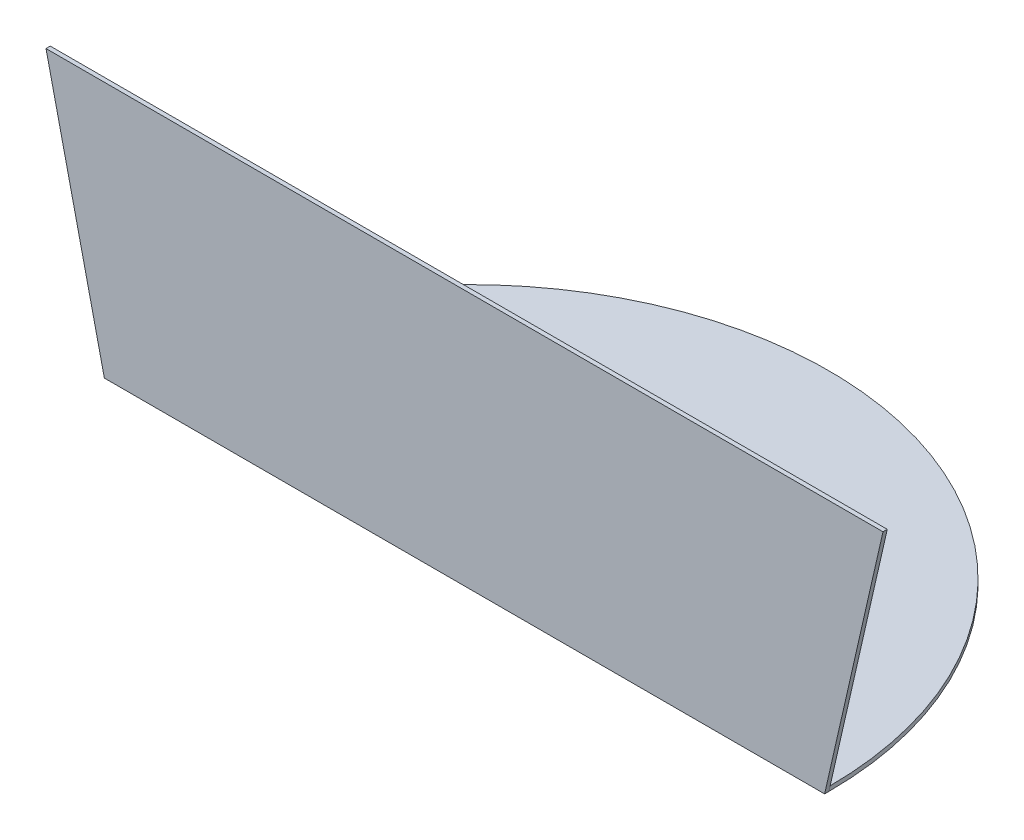
ISO-10303-21;
HEADER;
FILE_DESCRIPTION(('STEP AP214'),'2;1');
FILE_NAME('part.step','',(''),(''),'','','');
FILE_SCHEMA(('AUTOMOTIVE_DESIGN { 1 0 10303 214 1 1 1 1 }'));
ENDSEC;
DATA;
#1=APPLICATION_CONTEXT('core data for automotive mechanical design processes');
#2=APPLICATION_PROTOCOL_DEFINITION('international standard','automotive_design',2000,#1);
#3=PRODUCT_CONTEXT('',#1,'mechanical');
#4=PRODUCT('Part','Part','',(#3));
#5=PRODUCT_RELATED_PRODUCT_CATEGORY('part','',(#4));
#6=PRODUCT_DEFINITION_FORMATION('','',#4);
#7=PRODUCT_DEFINITION_CONTEXT('part definition',#1,'design');
#8=PRODUCT_DEFINITION('design','',#6,#7);
#9=PRODUCT_DEFINITION_SHAPE('','',#8);
#10=(LENGTH_UNIT() NAMED_UNIT(*) SI_UNIT(.MILLI.,.METRE.));
#11=(NAMED_UNIT(*) PLANE_ANGLE_UNIT() SI_UNIT($,.RADIAN.));
#12=(NAMED_UNIT(*) SI_UNIT($,.STERADIAN.) SOLID_ANGLE_UNIT());
#13=UNCERTAINTY_MEASURE_WITH_UNIT(LENGTH_MEASURE(1.E-05),#10,'distance_accuracy_value','');
#14=(GEOMETRIC_REPRESENTATION_CONTEXT(3) GLOBAL_UNCERTAINTY_ASSIGNED_CONTEXT((#13)) GLOBAL_UNIT_ASSIGNED_CONTEXT((#10,
#11,#12)) REPRESENTATION_CONTEXT('',''));
#15=CARTESIAN_POINT('',(0.,0.,0.));
#16=DIRECTION('',(0.,0.,1.));
#17=DIRECTION('',(1.,0.,0.));
#18=AXIS2_PLACEMENT_3D('',#15,#16,#17);
#19=CARTESIAN_POINT('',(0.,1.5,0.));
#20=DIRECTION('',(0.,-1.,0.));
#21=DIRECTION('',(0.,0.,-1.));
#22=AXIS2_PLACEMENT_3D('',#19,#20,#21);
#23=CYLINDRICAL_SURFACE('',#22,126.5);
#24=CARTESIAN_POINT('',(0.,0.,0.));
#25=DIRECTION('',(0.,1.,0.));
#26=DIRECTION('',(0.,0.,1.));
#27=AXIS2_PLACEMENT_3D('',#24,#25,#26);
#28=CIRCLE('',#27,126.5);
#29=CARTESIAN_POINT('',(126.5,0.,0.));
#30=VERTEX_POINT('',#29);
#31=CARTESIAN_POINT('',(-126.5,0.,0.));
#32=VERTEX_POINT('',#31);
#33=EDGE_CURVE('E99',#30,#32,#28,.T.);
#34=ORIENTED_EDGE('',*,*,#33,.T.);
#35=DIRECTION('',(0.,-1.,0.));
#36=VECTOR('',#35,1.);
#37=CARTESIAN_POINT('',(-126.5,1.5,0.));
#38=LINE('',#37,#36);
#39=CARTESIAN_POINT('',(-126.5,1.5,0.));
#40=VERTEX_POINT('',#39);
#41=EDGE_CURVE('E43',#40,#32,#38,.T.);
#42=ORIENTED_EDGE('',*,*,#41,.F.);
#43=CARTESIAN_POINT('',(0.,1.5,0.));
#44=DIRECTION('',(0.,1.,0.));
#45=DIRECTION('',(0.,0.,1.));
#46=AXIS2_PLACEMENT_3D('',#43,#44,#45);
#47=CIRCLE('',#46,126.5);
#48=CARTESIAN_POINT('',(126.5,1.5,0.));
#49=VERTEX_POINT('',#48);
#50=EDGE_CURVE('E49',#49,#40,#47,.T.);
#51=ORIENTED_EDGE('',*,*,#50,.F.);
#52=DIRECTION('',(0.,-1.,0.));
#53=VECTOR('',#52,1.);
#54=CARTESIAN_POINT('',(126.5,1.5,0.));
#55=LINE('',#54,#53);
#56=EDGE_CURVE('E11',#49,#30,#55,.T.);
#57=ORIENTED_EDGE('',*,*,#56,.T.);
#58=EDGE_LOOP('',(#34,#42,#51,#57));
#59=FACE_BOUND('',#58,.T.);
#60=ADVANCED_FACE('F35',(#59),#23,.T.);
#61=CARTESIAN_POINT('',(0.,1.5,0.));
#62=DIRECTION('',(0.,1.,0.));
#63=DIRECTION('',(0.,0.,1.));
#64=AXIS2_PLACEMENT_3D('',#61,#62,#63);
#65=PLANE('',#64);
#66=DIRECTION('',(1.,0.,0.));
#67=VECTOR('',#66,1.);
#68=CARTESIAN_POINT('',(0.,1.5,0.));
#69=LINE('',#68,#67);
#70=EDGE_CURVE('E102',#40,#49,#69,.T.);
#71=ORIENTED_EDGE('',*,*,#70,.T.);
#72=ORIENTED_EDGE('',*,*,#50,.T.);
#73=EDGE_LOOP('',(#71,#72));
#74=FACE_BOUND('',#73,.T.);
#75=ADVANCED_FACE('F133',(#74),#65,.T.);
#76=CARTESIAN_POINT('',(0.,0.,0.));
#77=DIRECTION('',(0.,1.,0.));
#78=DIRECTION('',(0.,0.,1.));
#79=AXIS2_PLACEMENT_3D('',#76,#77,#78);
#80=PLANE('',#79);
#81=ORIENTED_EDGE('',*,*,#33,.F.);
#82=DIRECTION('',(0.,0.,-1.));
#83=VECTOR('',#82,1.);
#84=CARTESIAN_POINT('',(126.5,0.,1.5));
#85=LINE('',#84,#83);
#86=CARTESIAN_POINT('',(126.5,0.,1.5));
#87=VERTEX_POINT('',#86);
#88=EDGE_CURVE('E79',#87,#30,#85,.T.);
#89=ORIENTED_EDGE('',*,*,#88,.F.);
#90=DIRECTION('',(1.,0.,0.));
#91=VECTOR('',#90,1.);
#92=CARTESIAN_POINT('',(-126.5,0.,1.5));
#93=LINE('',#92,#91);
#94=CARTESIAN_POINT('',(-126.5,0.,1.5));
#95=VERTEX_POINT('',#94);
#96=EDGE_CURVE('E85',#95,#87,#93,.T.);
#97=ORIENTED_EDGE('',*,*,#96,.F.);
#98=DIRECTION('',(0.,0.,-1.));
#99=VECTOR('',#98,1.);
#100=CARTESIAN_POINT('',(-126.5,0.,1.5));
#101=LINE('',#100,#99);
#102=EDGE_CURVE('E121',#95,#32,#101,.T.);
#103=ORIENTED_EDGE('',*,*,#102,.T.);
#104=EDGE_LOOP('',(#81,#89,#97,#103));
#105=FACE_BOUND('',#104,.T.);
#106=ADVANCED_FACE('F97',(#105),#80,.F.);
#107=CARTESIAN_POINT('',(0.,0.,0.));
#108=DIRECTION('',(0.,0.,1.));
#109=DIRECTION('',(1.,0.,0.));
#110=AXIS2_PLACEMENT_3D('',#107,#108,#109);
#111=PLANE('',#110);
#112=ORIENTED_EDGE('',*,*,#70,.F.);
#113=ORIENTED_EDGE('',*,*,#41,.T.);
#114=DIRECTION('',(0.222089329055008,-0.975026322680519,0.));
#115=VECTOR('',#114,1.);
#116=CARTESIAN_POINT('',(-147.,90.,0.));
#117=LINE('',#116,#115);
#118=CARTESIAN_POINT('',(-147.,90.,0.));
#119=VERTEX_POINT('',#118);
#120=EDGE_CURVE('E94',#119,#32,#117,.T.);
#121=ORIENTED_EDGE('',*,*,#120,.F.);
#122=DIRECTION('',(-1.,0.,0.));
#123=VECTOR('',#122,1.);
#124=CARTESIAN_POINT('',(147.,90.,0.));
#125=LINE('',#124,#123);
#126=CARTESIAN_POINT('',(147.,90.,0.));
#127=VERTEX_POINT('',#126);
#128=EDGE_CURVE('E123',#127,#119,#125,.T.);
#129=ORIENTED_EDGE('',*,*,#128,.F.);
#130=DIRECTION('',(0.222089329055007,0.97502632268052,0.));
#131=VECTOR('',#130,1.);
#132=CARTESIAN_POINT('',(126.5,0.,0.));
#133=LINE('',#132,#131);
#134=EDGE_CURVE('E129',#30,#127,#133,.T.);
#135=ORIENTED_EDGE('',*,*,#134,.F.);
#136=ORIENTED_EDGE('',*,*,#56,.F.);
#137=EDGE_LOOP('',(#112,#113,#121,#129,#135,#136));
#138=FACE_BOUND('',#137,.T.);
#139=ADVANCED_FACE('F114',(#138),#111,.F.);
#140=CARTESIAN_POINT('',(126.5,0.,1.5));
#141=DIRECTION('',(-0.97502632268052,0.222089329055007,0.));
#142=DIRECTION('',(-0.222089329055007,-0.97502632268052,0.));
#143=AXIS2_PLACEMENT_3D('',#140,#141,#142);
#144=PLANE('',#143);
#145=ORIENTED_EDGE('',*,*,#134,.T.);
#146=DIRECTION('',(0.,0.,-1.));
#147=VECTOR('',#146,1.);
#148=CARTESIAN_POINT('',(147.,90.,1.5));
#149=LINE('',#148,#147);
#150=CARTESIAN_POINT('',(147.,90.,1.5));
#151=VERTEX_POINT('',#150);
#152=EDGE_CURVE('E81',#151,#127,#149,.T.);
#153=ORIENTED_EDGE('',*,*,#152,.F.);
#154=DIRECTION('',(0.222089329055007,0.97502632268052,0.));
#155=VECTOR('',#154,1.);
#156=CARTESIAN_POINT('',(126.5,0.,1.5));
#157=LINE('',#156,#155);
#158=EDGE_CURVE('E75',#87,#151,#157,.T.);
#159=ORIENTED_EDGE('',*,*,#158,.F.);
#160=ORIENTED_EDGE('',*,*,#88,.T.);
#161=EDGE_LOOP('',(#145,#153,#159,#160));
#162=FACE_BOUND('',#161,.T.);
#163=ADVANCED_FACE('F77',(#162),#144,.F.);
#164=CARTESIAN_POINT('',(147.,90.,1.5));
#165=DIRECTION('',(0.,-1.,0.));
#166=DIRECTION('',(1.,0.,0.));
#167=AXIS2_PLACEMENT_3D('',#164,#165,#166);
#168=PLANE('',#167);
#169=ORIENTED_EDGE('',*,*,#128,.T.);
#170=DIRECTION('',(0.,0.,-1.));
#171=VECTOR('',#170,1.);
#172=CARTESIAN_POINT('',(-147.,90.,1.5));
#173=LINE('',#172,#171);
#174=CARTESIAN_POINT('',(-147.,90.,1.5));
#175=VERTEX_POINT('',#174);
#176=EDGE_CURVE('E104',#175,#119,#173,.T.);
#177=ORIENTED_EDGE('',*,*,#176,.F.);
#178=DIRECTION('',(-1.,0.,0.));
#179=VECTOR('',#178,1.);
#180=CARTESIAN_POINT('',(147.,90.,1.5));
#181=LINE('',#180,#179);
#182=EDGE_CURVE('E84',#151,#175,#181,.T.);
#183=ORIENTED_EDGE('',*,*,#182,.F.);
#184=ORIENTED_EDGE('',*,*,#152,.T.);
#185=EDGE_LOOP('',(#169,#177,#183,#184));
#186=FACE_BOUND('',#185,.T.);
#187=ADVANCED_FACE('F132',(#186),#168,.F.);
#188=CARTESIAN_POINT('',(-147.,90.,1.5));
#189=DIRECTION('',(0.975026322680519,0.222089329055008,0.));
#190=DIRECTION('',(-0.222089329055008,0.97502632268052,0.));
#191=AXIS2_PLACEMENT_3D('',#188,#189,#190);
#192=PLANE('',#191);
#193=ORIENTED_EDGE('',*,*,#120,.T.);
#194=ORIENTED_EDGE('',*,*,#102,.F.);
#195=DIRECTION('',(0.222089329055008,-0.975026322680519,0.));
#196=VECTOR('',#195,1.);
#197=CARTESIAN_POINT('',(-147.,90.,1.5));
#198=LINE('',#197,#196);
#199=EDGE_CURVE('E90',#175,#95,#198,.T.);
#200=ORIENTED_EDGE('',*,*,#199,.F.);
#201=ORIENTED_EDGE('',*,*,#176,.T.);
#202=EDGE_LOOP('',(#193,#194,#200,#201));
#203=FACE_BOUND('',#202,.T.);
#204=ADVANCED_FACE('F120',(#203),#192,.F.);
#205=CARTESIAN_POINT('',(0.,0.,1.5));
#206=DIRECTION('',(0.,0.,1.));
#207=DIRECTION('',(1.,0.,0.));
#208=AXIS2_PLACEMENT_3D('',#205,#206,#207);
#209=PLANE('',#208);
#210=ORIENTED_EDGE('',*,*,#96,.T.);
#211=ORIENTED_EDGE('',*,*,#158,.T.);
#212=ORIENTED_EDGE('',*,*,#182,.T.);
#213=ORIENTED_EDGE('',*,*,#199,.T.);
#214=EDGE_LOOP('',(#210,#211,#212,#213));
#215=FACE_BOUND('',#214,.T.);
#216=ADVANCED_FACE('F88',(#215),#209,.T.);
#217=CLOSED_SHELL('',(#60,#75,#106,#139,#163,#187,#204,#216));
#218=MANIFOLD_SOLID_BREP('B2',#217);
#219=ADVANCED_BREP_SHAPE_REPRESENTATION('',(#18,#218),#14);
#220=SHAPE_DEFINITION_REPRESENTATION(#9,#219);
ENDSEC;
END-ISO-10303-21;
